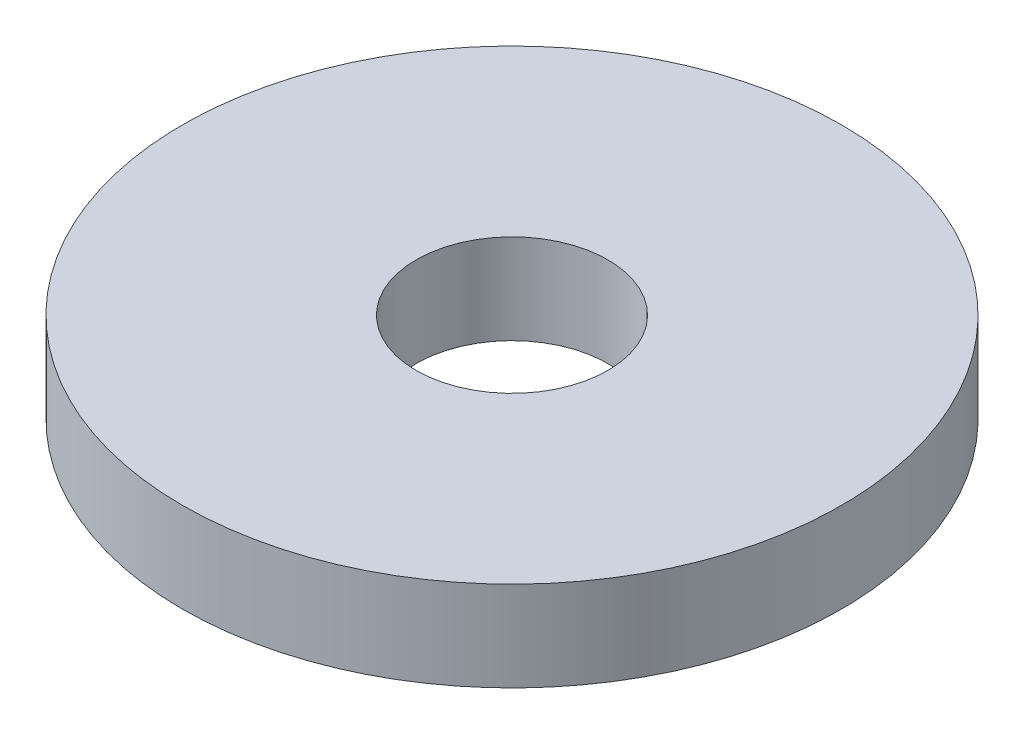
ISO-10303-21;
HEADER;
FILE_DESCRIPTION(('STEP AP214'),'2;1');
FILE_NAME('part.step','',(''),(''),'','','');
FILE_SCHEMA(('AUTOMOTIVE_DESIGN { 1 0 10303 214 1 1 1 1 }'));
ENDSEC;
DATA;
#1=APPLICATION_CONTEXT('core data for automotive mechanical design processes');
#2=APPLICATION_PROTOCOL_DEFINITION('international standard','automotive_design',2000,#1);
#3=PRODUCT_CONTEXT('',#1,'mechanical');
#4=PRODUCT('Part','Part','',(#3));
#5=PRODUCT_RELATED_PRODUCT_CATEGORY('part','',(#4));
#6=PRODUCT_DEFINITION_FORMATION('','',#4);
#7=PRODUCT_DEFINITION_CONTEXT('part definition',#1,'design');
#8=PRODUCT_DEFINITION('design','',#6,#7);
#9=PRODUCT_DEFINITION_SHAPE('','',#8);
#10=(LENGTH_UNIT() NAMED_UNIT(*) SI_UNIT(.MILLI.,.METRE.));
#11=(NAMED_UNIT(*) PLANE_ANGLE_UNIT() SI_UNIT($,.RADIAN.));
#12=(NAMED_UNIT(*) SI_UNIT($,.STERADIAN.) SOLID_ANGLE_UNIT());
#13=UNCERTAINTY_MEASURE_WITH_UNIT(LENGTH_MEASURE(1.E-05),#10,'distance_accuracy_value','');
#14=(GEOMETRIC_REPRESENTATION_CONTEXT(3) GLOBAL_UNCERTAINTY_ASSIGNED_CONTEXT((#13)) GLOBAL_UNIT_ASSIGNED_CONTEXT((#10,
#11,#12)) REPRESENTATION_CONTEXT('',''));
#15=CARTESIAN_POINT('',(0.,0.,0.));
#16=DIRECTION('',(0.,0.,1.));
#17=DIRECTION('',(1.,0.,0.));
#18=AXIS2_PLACEMENT_3D('',#15,#16,#17);
#19=CARTESIAN_POINT('',(0.,3.,0.));
#20=DIRECTION('',(0.,1.,0.));
#21=DIRECTION('',(0.,0.,1.));
#22=AXIS2_PLACEMENT_3D('',#19,#20,#21);
#23=PLANE('',#22);
#24=CARTESIAN_POINT('',(0.,3.,0.));
#25=DIRECTION('',(0.,1.,0.));
#26=DIRECTION('',(0.,0.,1.));
#27=AXIS2_PLACEMENT_3D('',#24,#25,#26);
#28=CIRCLE('',#27,11.);
#29=CARTESIAN_POINT('',(0.,3.,11.));
#30=VERTEX_POINT('',#29);
#31=EDGE_CURVE('E10',#30,#30,#28,.T.);
#32=ORIENTED_EDGE('',*,*,#31,.T.);
#33=EDGE_LOOP('',(#32));
#34=FACE_BOUND('',#33,.T.);
#35=CARTESIAN_POINT('',(0.,3.,0.));
#36=DIRECTION('',(0.,1.,0.));
#37=DIRECTION('',(0.,0.,1.));
#38=AXIS2_PLACEMENT_3D('',#35,#36,#37);
#39=CIRCLE('',#38,3.2);
#40=CARTESIAN_POINT('',(0.,3.,3.2));
#41=VERTEX_POINT('',#40);
#42=EDGE_CURVE('E50',#41,#41,#39,.T.);
#43=ORIENTED_EDGE('',*,*,#42,.F.);
#44=EDGE_LOOP('',(#43));
#45=FACE_BOUND('',#44,.T.);
#46=ADVANCED_FACE('F37',(#34,#45),#23,.T.);
#47=CARTESIAN_POINT('',(0.,0.,0.));
#48=DIRECTION('',(0.,1.,0.));
#49=DIRECTION('',(0.,0.,1.));
#50=AXIS2_PLACEMENT_3D('',#47,#48,#49);
#51=PLANE('',#50);
#52=CARTESIAN_POINT('',(0.,0.,0.));
#53=DIRECTION('',(0.,1.,0.));
#54=DIRECTION('',(0.,0.,1.));
#55=AXIS2_PLACEMENT_3D('',#52,#53,#54);
#56=CIRCLE('',#55,11.);
#57=CARTESIAN_POINT('',(0.,0.,11.));
#58=VERTEX_POINT('',#57);
#59=EDGE_CURVE('E41',#58,#58,#56,.T.);
#60=ORIENTED_EDGE('',*,*,#59,.F.);
#61=EDGE_LOOP('',(#60));
#62=FACE_BOUND('',#61,.T.);
#63=CARTESIAN_POINT('',(0.,0.,0.));
#64=DIRECTION('',(0.,1.,0.));
#65=DIRECTION('',(0.,0.,1.));
#66=AXIS2_PLACEMENT_3D('',#63,#64,#65);
#67=CIRCLE('',#66,3.2);
#68=CARTESIAN_POINT('',(0.,0.,3.2));
#69=VERTEX_POINT('',#68);
#70=EDGE_CURVE('E52',#69,#69,#67,.T.);
#71=ORIENTED_EDGE('',*,*,#70,.T.);
#72=EDGE_LOOP('',(#71));
#73=FACE_BOUND('',#72,.T.);
#74=ADVANCED_FACE('F64',(#62,#73),#51,.F.);
#75=CARTESIAN_POINT('',(0.,3.,0.));
#76=DIRECTION('',(0.,-1.,0.));
#77=DIRECTION('',(0.,0.,-1.));
#78=AXIS2_PLACEMENT_3D('',#75,#76,#77);
#79=CYLINDRICAL_SURFACE('',#78,11.);
#80=ORIENTED_EDGE('',*,*,#31,.F.);
#81=EDGE_LOOP('',(#80));
#82=FACE_BOUND('',#81,.T.);
#83=ORIENTED_EDGE('',*,*,#59,.T.);
#84=EDGE_LOOP('',(#83));
#85=FACE_BOUND('',#84,.T.);
#86=ADVANCED_FACE('F39',(#82,#85),#79,.T.);
#87=CARTESIAN_POINT('',(0.,3.,0.));
#88=DIRECTION('',(0.,-1.,0.));
#89=DIRECTION('',(0.,0.,-1.));
#90=AXIS2_PLACEMENT_3D('',#87,#88,#89);
#91=CYLINDRICAL_SURFACE('',#90,3.2);
#92=ORIENTED_EDGE('',*,*,#42,.T.);
#93=EDGE_LOOP('',(#92));
#94=FACE_BOUND('',#93,.T.);
#95=ORIENTED_EDGE('',*,*,#70,.F.);
#96=EDGE_LOOP('',(#95));
#97=FACE_BOUND('',#96,.T.);
#98=ADVANCED_FACE('F60',(#94,#97),#91,.F.);
#99=CLOSED_SHELL('',(#46,#74,#86,#98));
#100=MANIFOLD_SOLID_BREP('B2',#99);
#101=ADVANCED_BREP_SHAPE_REPRESENTATION('',(#18,#100),#14);
#102=SHAPE_DEFINITION_REPRESENTATION(#9,#101);
ENDSEC;
END-ISO-10303-21;
